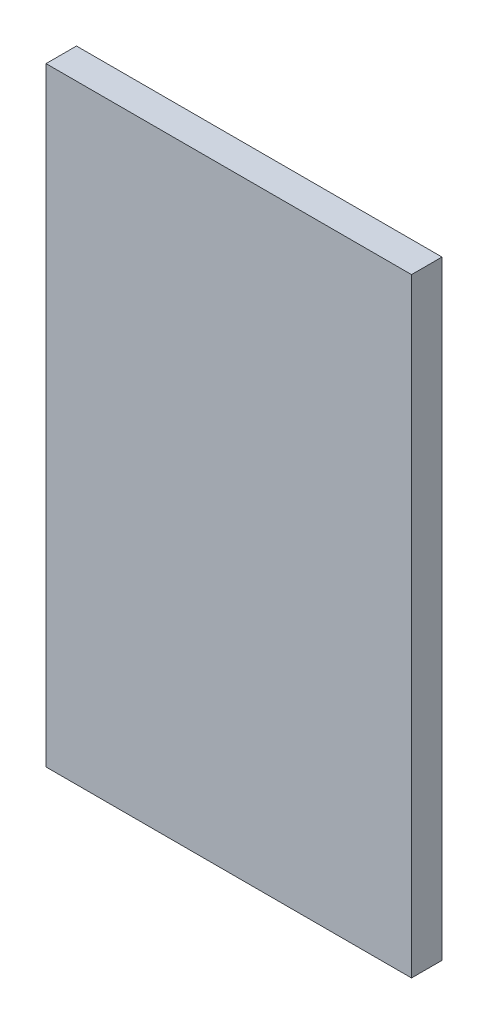
ISO-10303-21;
HEADER;
FILE_DESCRIPTION(('STEP AP214'),'2;1');
FILE_NAME('part.step','',(''),(''),'','','');
FILE_SCHEMA(('AUTOMOTIVE_DESIGN { 1 0 10303 214 1 1 1 1 }'));
ENDSEC;
DATA;
#1=APPLICATION_CONTEXT('core data for automotive mechanical design processes');
#2=APPLICATION_PROTOCOL_DEFINITION('international standard','automotive_design',2000,#1);
#3=PRODUCT_CONTEXT('',#1,'mechanical');
#4=PRODUCT('Part','Part','',(#3));
#5=PRODUCT_RELATED_PRODUCT_CATEGORY('part','',(#4));
#6=PRODUCT_DEFINITION_FORMATION('','',#4);
#7=PRODUCT_DEFINITION_CONTEXT('part definition',#1,'design');
#8=PRODUCT_DEFINITION('design','',#6,#7);
#9=PRODUCT_DEFINITION_SHAPE('','',#8);
#10=(LENGTH_UNIT() NAMED_UNIT(*) SI_UNIT(.MILLI.,.METRE.));
#11=(NAMED_UNIT(*) PLANE_ANGLE_UNIT() SI_UNIT($,.RADIAN.));
#12=(NAMED_UNIT(*) SI_UNIT($,.STERADIAN.) SOLID_ANGLE_UNIT());
#13=UNCERTAINTY_MEASURE_WITH_UNIT(LENGTH_MEASURE(1.E-05),#10,'distance_accuracy_value','');
#14=(GEOMETRIC_REPRESENTATION_CONTEXT(3) GLOBAL_UNCERTAINTY_ASSIGNED_CONTEXT((#13)) GLOBAL_UNIT_ASSIGNED_CONTEXT((#10,
#11,#12)) REPRESENTATION_CONTEXT('',''));
#15=CARTESIAN_POINT('',(0.,0.,0.));
#16=DIRECTION('',(0.,0.,1.));
#17=DIRECTION('',(1.,0.,0.));
#18=AXIS2_PLACEMENT_3D('',#15,#16,#17);
#19=CARTESIAN_POINT('',(0.,0.,6.35));
#20=DIRECTION('',(1.,0.,0.));
#21=DIRECTION('',(0.,0.,-1.));
#22=AXIS2_PLACEMENT_3D('',#19,#20,#21);
#23=PLANE('',#22);
#24=DIRECTION('',(0.,-1.,0.));
#25=VECTOR('',#24,1.);
#26=CARTESIAN_POINT('',(0.,0.,0.));
#27=LINE('',#26,#25);
#28=CARTESIAN_POINT('',(0.,127.,0.));
#29=VERTEX_POINT('',#28);
#30=CARTESIAN_POINT('',(0.,0.,0.));
#31=VERTEX_POINT('',#30);
#32=EDGE_CURVE('E97',#29,#31,#27,.T.);
#33=ORIENTED_EDGE('',*,*,#32,.T.);
#34=DIRECTION('',(0.,0.,-1.));
#35=VECTOR('',#34,1.);
#36=CARTESIAN_POINT('',(0.,0.,6.35));
#37=LINE('',#36,#35);
#38=CARTESIAN_POINT('',(0.,0.,6.35));
#39=VERTEX_POINT('',#38);
#40=EDGE_CURVE('E11',#39,#31,#37,.T.);
#41=ORIENTED_EDGE('',*,*,#40,.F.);
#42=DIRECTION('',(0.,-1.,0.));
#43=VECTOR('',#42,1.);
#44=CARTESIAN_POINT('',(0.,0.,6.35));
#45=LINE('',#44,#43);
#46=CARTESIAN_POINT('',(0.,127.,6.35));
#47=VERTEX_POINT('',#46);
#48=EDGE_CURVE('E85',#47,#39,#45,.T.);
#49=ORIENTED_EDGE('',*,*,#48,.F.);
#50=DIRECTION('',(0.,0.,-1.));
#51=VECTOR('',#50,1.);
#52=CARTESIAN_POINT('',(0.,127.,6.35));
#53=LINE('',#52,#51);
#54=EDGE_CURVE('E93',#47,#29,#53,.T.);
#55=ORIENTED_EDGE('',*,*,#54,.T.);
#56=EDGE_LOOP('',(#33,#41,#49,#55));
#57=FACE_BOUND('',#56,.T.);
#58=ADVANCED_FACE('F34',(#57),#23,.F.);
#59=CARTESIAN_POINT('',(0.,0.,6.35));
#60=DIRECTION('',(0.,1.,0.));
#61=DIRECTION('',(0.,0.,1.));
#62=AXIS2_PLACEMENT_3D('',#59,#60,#61);
#63=PLANE('',#62);
#64=DIRECTION('',(1.,0.,0.));
#65=VECTOR('',#64,1.);
#66=CARTESIAN_POINT('',(0.,0.,0.));
#67=LINE('',#66,#65);
#68=CARTESIAN_POINT('',(76.2,0.,0.));
#69=VERTEX_POINT('',#68);
#70=EDGE_CURVE('E89',#31,#69,#67,.T.);
#71=ORIENTED_EDGE('',*,*,#70,.T.);
#72=DIRECTION('',(0.,0.,-1.));
#73=VECTOR('',#72,1.);
#74=CARTESIAN_POINT('',(76.2,0.,6.35));
#75=LINE('',#74,#73);
#76=CARTESIAN_POINT('',(76.2,0.,6.35));
#77=VERTEX_POINT('',#76);
#78=EDGE_CURVE('E42',#77,#69,#75,.T.);
#79=ORIENTED_EDGE('',*,*,#78,.F.);
#80=DIRECTION('',(1.,0.,0.));
#81=VECTOR('',#80,1.);
#82=CARTESIAN_POINT('',(0.,0.,6.35));
#83=LINE('',#82,#81);
#84=EDGE_CURVE('E80',#39,#77,#83,.T.);
#85=ORIENTED_EDGE('',*,*,#84,.F.);
#86=ORIENTED_EDGE('',*,*,#40,.T.);
#87=EDGE_LOOP('',(#71,#79,#85,#86));
#88=FACE_BOUND('',#87,.T.);
#89=ADVANCED_FACE('F88',(#88),#63,.F.);
#90=CARTESIAN_POINT('',(76.2,0.,6.35));
#91=DIRECTION('',(-1.,0.,0.));
#92=DIRECTION('',(0.,0.,1.));
#93=AXIS2_PLACEMENT_3D('',#90,#91,#92);
#94=PLANE('',#93);
#95=DIRECTION('',(0.,1.,0.));
#96=VECTOR('',#95,1.);
#97=CARTESIAN_POINT('',(76.2,0.,0.));
#98=LINE('',#97,#96);
#99=CARTESIAN_POINT('',(76.2,127.,0.));
#100=VERTEX_POINT('',#99);
#101=EDGE_CURVE('E67',#69,#100,#98,.T.);
#102=ORIENTED_EDGE('',*,*,#101,.T.);
#103=DIRECTION('',(0.,0.,-1.));
#104=VECTOR('',#103,1.);
#105=CARTESIAN_POINT('',(76.2,127.,6.35));
#106=LINE('',#105,#104);
#107=CARTESIAN_POINT('',(76.2,127.,6.35));
#108=VERTEX_POINT('',#107);
#109=EDGE_CURVE('E90',#108,#100,#106,.T.);
#110=ORIENTED_EDGE('',*,*,#109,.F.);
#111=DIRECTION('',(0.,1.,0.));
#112=VECTOR('',#111,1.);
#113=CARTESIAN_POINT('',(76.2,0.,6.35));
#114=LINE('',#113,#112);
#115=EDGE_CURVE('E83',#77,#108,#114,.T.);
#116=ORIENTED_EDGE('',*,*,#115,.F.);
#117=ORIENTED_EDGE('',*,*,#78,.T.);
#118=EDGE_LOOP('',(#102,#110,#116,#117));
#119=FACE_BOUND('',#118,.T.);
#120=ADVANCED_FACE('F91',(#119),#94,.F.);
#121=CARTESIAN_POINT('',(0.,127.,6.35));
#122=DIRECTION('',(0.,-1.,0.));
#123=DIRECTION('',(0.,0.,-1.));
#124=AXIS2_PLACEMENT_3D('',#121,#122,#123);
#125=PLANE('',#124);
#126=DIRECTION('',(-1.,0.,0.));
#127=VECTOR('',#126,1.);
#128=CARTESIAN_POINT('',(0.,127.,0.));
#129=LINE('',#128,#127);
#130=EDGE_CURVE('E73',#100,#29,#129,.T.);
#131=ORIENTED_EDGE('',*,*,#130,.T.);
#132=ORIENTED_EDGE('',*,*,#54,.F.);
#133=DIRECTION('',(-1.,0.,0.));
#134=VECTOR('',#133,1.);
#135=CARTESIAN_POINT('',(0.,127.,6.35));
#136=LINE('',#135,#134);
#137=EDGE_CURVE('E50',#108,#47,#136,.T.);
#138=ORIENTED_EDGE('',*,*,#137,.F.);
#139=ORIENTED_EDGE('',*,*,#109,.T.);
#140=EDGE_LOOP('',(#131,#132,#138,#139));
#141=FACE_BOUND('',#140,.T.);
#142=ADVANCED_FACE('F104',(#141),#125,.F.);
#143=CARTESIAN_POINT('',(0.,0.,6.35));
#144=DIRECTION('',(0.,0.,-1.));
#145=DIRECTION('',(-1.,0.,0.));
#146=AXIS2_PLACEMENT_3D('',#143,#144,#145);
#147=PLANE('',#146);
#148=ORIENTED_EDGE('',*,*,#48,.T.);
#149=ORIENTED_EDGE('',*,*,#84,.T.);
#150=ORIENTED_EDGE('',*,*,#115,.T.);
#151=ORIENTED_EDGE('',*,*,#137,.T.);
#152=EDGE_LOOP('',(#148,#149,#150,#151));
#153=FACE_BOUND('',#152,.T.);
#154=ADVANCED_FACE('F81',(#153),#147,.F.);
#155=CARTESIAN_POINT('',(0.,0.,0.));
#156=DIRECTION('',(0.,0.,-1.));
#157=DIRECTION('',(-1.,0.,0.));
#158=AXIS2_PLACEMENT_3D('',#155,#156,#157);
#159=PLANE('',#158);
#160=ORIENTED_EDGE('',*,*,#32,.F.);
#161=ORIENTED_EDGE('',*,*,#130,.F.);
#162=ORIENTED_EDGE('',*,*,#101,.F.);
#163=ORIENTED_EDGE('',*,*,#70,.F.);
#164=EDGE_LOOP('',(#160,#161,#162,#163));
#165=FACE_BOUND('',#164,.T.);
#166=ADVANCED_FACE('F107',(#165),#159,.T.);
#167=CLOSED_SHELL('',(#58,#89,#120,#142,#154,#166));
#168=MANIFOLD_SOLID_BREP('B2',#167);
#169=ADVANCED_BREP_SHAPE_REPRESENTATION('',(#18,#168),#14);
#170=SHAPE_DEFINITION_REPRESENTATION(#9,#169);
ENDSEC;
END-ISO-10303-21;
